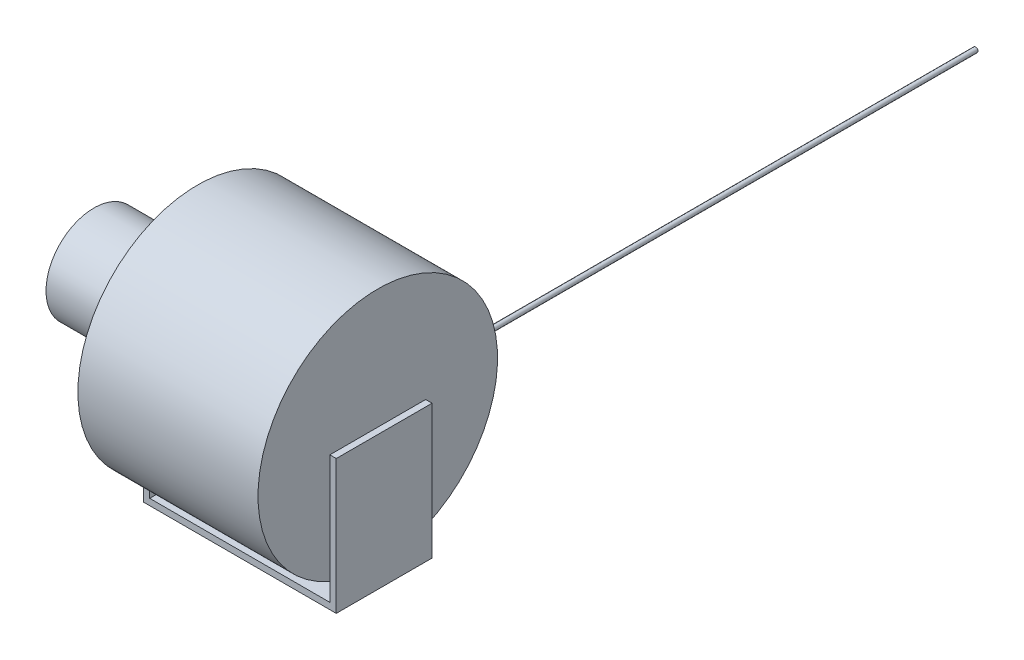
ISO-10303-21;
HEADER;
FILE_DESCRIPTION(('STEP AP214'),'2;1');
FILE_NAME('part.step','',(''),(''),'','','');
FILE_SCHEMA(('AUTOMOTIVE_DESIGN { 1 0 10303 214 1 1 1 1 }'));
ENDSEC;
DATA;
#1=APPLICATION_CONTEXT('core data for automotive mechanical design processes');
#2=APPLICATION_PROTOCOL_DEFINITION('international standard','automotive_design',2000,#1);
#3=PRODUCT_CONTEXT('',#1,'mechanical');
#4=PRODUCT('Part','Part','',(#3));
#5=PRODUCT_RELATED_PRODUCT_CATEGORY('part','',(#4));
#6=PRODUCT_DEFINITION_FORMATION('','',#4);
#7=PRODUCT_DEFINITION_CONTEXT('part definition',#1,'design');
#8=PRODUCT_DEFINITION('design','',#6,#7);
#9=PRODUCT_DEFINITION_SHAPE('','',#8);
#10=(LENGTH_UNIT() NAMED_UNIT(*) SI_UNIT(.MILLI.,.METRE.));
#11=(NAMED_UNIT(*) PLANE_ANGLE_UNIT() SI_UNIT($,.RADIAN.));
#12=(NAMED_UNIT(*) SI_UNIT($,.STERADIAN.) SOLID_ANGLE_UNIT());
#13=UNCERTAINTY_MEASURE_WITH_UNIT(LENGTH_MEASURE(1.E-05),#10,'distance_accuracy_value','');
#14=(GEOMETRIC_REPRESENTATION_CONTEXT(3) GLOBAL_UNCERTAINTY_ASSIGNED_CONTEXT((#13)) GLOBAL_UNIT_ASSIGNED_CONTEXT((#10,
#11,#12)) REPRESENTATION_CONTEXT('',''));
#15=CARTESIAN_POINT('',(0.,0.,0.));
#16=DIRECTION('',(0.,0.,1.));
#17=DIRECTION('',(1.,0.,0.));
#18=AXIS2_PLACEMENT_3D('',#15,#16,#17);
#19=CARTESIAN_POINT('',(282.,0.,0.));
#20=DIRECTION('',(-1.,0.,0.));
#21=DIRECTION('',(0.,0.,1.));
#22=AXIS2_PLACEMENT_3D('',#19,#20,#21);
#23=CYLINDRICAL_SURFACE('',#22,187.5);
#24=CARTESIAN_POINT('',(0.,0.,0.));
#25=DIRECTION('',(1.,0.,0.));
#26=DIRECTION('',(0.,0.,-1.));
#27=AXIS2_PLACEMENT_3D('',#24,#25,#26);
#28=CIRCLE('',#27,187.5);
#29=CARTESIAN_POINT('',(0.,-171.846588560844,75.));
#30=VERTEX_POINT('',#29);
#31=CARTESIAN_POINT('',(0.,-171.846588560844,-75.));
#32=VERTEX_POINT('',#31);
#33=EDGE_CURVE('E147',#30,#32,#28,.T.);
#34=ORIENTED_EDGE('',*,*,#33,.T.);
#35=EDGE_CURVE('E236',#32,#30,#28,.T.);
#36=ORIENTED_EDGE('',*,*,#35,.T.);
#37=EDGE_LOOP('',(#34,#36));
#38=FACE_BOUND('',#37,.T.);
#39=CARTESIAN_POINT('',(282.,0.,0.));
#40=DIRECTION('',(1.,0.,0.));
#41=DIRECTION('',(0.,0.,-1.));
#42=AXIS2_PLACEMENT_3D('',#39,#40,#41);
#43=CIRCLE('',#42,187.5);
#44=CARTESIAN_POINT('',(282.,-171.846588560844,75.));
#45=VERTEX_POINT('',#44);
#46=CARTESIAN_POINT('',(282.,-171.846588560844,-75.));
#47=VERTEX_POINT('',#46);
#48=EDGE_CURVE('E152',#45,#47,#43,.T.);
#49=ORIENTED_EDGE('',*,*,#48,.F.);
#50=EDGE_CURVE('E154',#47,#45,#43,.T.);
#51=ORIENTED_EDGE('',*,*,#50,.F.);
#52=EDGE_LOOP('',(#49,#51));
#53=FACE_BOUND('',#52,.T.);
#54=DIRECTION('',(-1.,0.,0.));
#55=VECTOR('',#54,1.);
#56=CARTESIAN_POINT('',(282.,-187.5,0.));
#57=LINE('',#56,#55);
#58=CARTESIAN_POINT('',(54.5,-187.5,0.));
#59=VERTEX_POINT('',#58);
#60=CARTESIAN_POINT('',(46.9,-187.5,0.));
#61=VERTEX_POINT('',#60);
#62=EDGE_CURVE('E11',#59,#61,#57,.T.);
#63=ORIENTED_EDGE('',*,*,#62,.F.);
#64=CARTESIAN_POINT('',(54.5,-187.5,0.));
#65=CARTESIAN_POINT('',(54.4999824772776,-187.500000118427,-0.633424812998008));
#66=CARTESIAN_POINT('',(54.499999371954,-187.496790188283,-1.26684962907386));
#67=CARTESIAN_POINT('',(54.4999762268592,-187.483951127179,-2.53362961792363));
#68=CARTESIAN_POINT('',(54.4999361874997,-187.474322042639,-3.16698479116805));
#69=CARTESIAN_POINT('',(54.4996733734448,-187.44864214647,-4.43373383816915));
#70=CARTESIAN_POINT('',(54.4994505500365,-187.432589623542,-5.06712767722962));
#71=CARTESIAN_POINT('',(54.4985722962712,-187.394064401529,-6.33372458783351));
#72=CARTESIAN_POINT('',(54.4979168626739,-187.371591654358,-6.96692765791254));
#73=CARTESIAN_POINT('',(54.4958313656798,-187.320207365941,-8.23359033330879));
#74=CARTESIAN_POINT('',(54.4944006689058,-187.291290571403,-8.86704972461049));
#75=CARTESIAN_POINT('',(54.490319941091,-187.227031872245,-10.1336385259812));
#76=CARTESIAN_POINT('',(54.4876699108114,-187.191689971636,-10.7667679362559));
#77=CARTESIAN_POINT('',(54.4806021822254,-187.114582757247,-12.0326661754178));
#78=CARTESIAN_POINT('',(54.4761843726716,-187.072817039316,-12.6654349791018));
#79=CARTESIAN_POINT('',(54.4649211462919,-186.982869690701,-13.9304899895));
#80=CARTESIAN_POINT('',(54.458075751287,-186.934688117692,-14.562776200501));
#81=CARTESIAN_POINT('',(54.4411722576911,-186.831910366129,-15.8268578519086));
#82=CARTESIAN_POINT('',(54.4311137941678,-186.777313459383,-16.4586532283927));
#83=CARTESIAN_POINT('',(54.4068553454479,-186.661720468519,-17.7215740820794));
#84=CARTESIAN_POINT('',(54.3926554045928,-186.600724452918,-18.3526995663816));
#85=CARTESIAN_POINT('',(54.3590090515758,-186.47235320213,-19.6141113214793));
#86=CARTESIAN_POINT('',(54.3395630795642,-186.404978502432,-20.2443976582242));
#87=CARTESIAN_POINT('',(54.2940895327265,-186.263869446385,-21.5040127127352));
#88=CARTESIAN_POINT('',(54.2680620855783,-186.190135213427,-22.1333414488402));
#89=CARTESIAN_POINT('',(54.2077749739849,-186.036323744766,-23.3909734988482));
#90=CARTESIAN_POINT('',(54.1735135616537,-185.956245164724,-24.0192765664756));
#91=CARTESIAN_POINT('',(54.0946623520816,-185.789809595233,-25.2744428144783));
#92=CARTESIAN_POINT('',(54.0500720329202,-185.703452288671,-25.9013059204751));
#93=CARTESIAN_POINT('',(53.9478339692521,-185.524593796126,-27.1527966565233));
#94=CARTESIAN_POINT('',(53.8901928952217,-185.432095765788,-27.7774252635706));
#95=CARTESIAN_POINT('',(53.7909727615141,-185.288839581068,-28.7122855507101));
#96=CARTESIAN_POINT('',(53.7557748734541,-185.240338328345,-29.0235442889877));
#97=CARTESIAN_POINT('',(53.6804439330576,-185.141863222087,-29.6452274269418));
#98=CARTESIAN_POINT('',(53.6403110295331,-185.091889412991,-29.9556518514883));
#99=CARTESIAN_POINT('',(53.5631002833752,-185.000911234695,-30.511885359387));
#100=CARTESIAN_POINT('',(53.5270849174587,-184.960170153332,-30.7578848088501));
#101=CARTESIAN_POINT('',(53.4508707364032,-184.877813697329,-31.2490962600433));
#102=CARTESIAN_POINT('',(53.4106718527476,-184.83619830838,-31.4943082488087));
#103=CARTESIAN_POINT('',(53.3254139105878,-184.752130163623,-31.9837781847893));
#104=CARTESIAN_POINT('',(53.2803542682803,-184.709677307733,-32.2280360137461));
#105=CARTESIAN_POINT('',(53.18450421325,-184.624000377655,-32.7152817902282));
#106=CARTESIAN_POINT('',(53.1337141349475,-184.580776348596,-32.9582698109927));
#107=CARTESIAN_POINT('',(53.0193583261608,-184.488931853758,-33.4687668034435));
#108=CARTESIAN_POINT('',(52.9550050541532,-184.440233146771,-33.7360869241306));
#109=CARTESIAN_POINT('',(52.8155853593365,-184.342215939266,-34.2676280204516));
#110=CARTESIAN_POINT('',(52.7405276229526,-184.292897970572,-34.5318513227575));
#111=CARTESIAN_POINT('',(52.5993137317499,-184.207993296485,-34.9814482347508));
#112=CARTESIAN_POINT('',(52.5366692917565,-184.172478738763,-35.1679337032965));
#113=CARTESIAN_POINT('',(52.4016840695511,-184.101448430046,-35.5378975094847));
#114=CARTESIAN_POINT('',(52.3293237698678,-184.065932824378,-35.7213689374464));
#115=CARTESIAN_POINT('',(52.2101653011699,-184.012691302288,-35.9942815203409));
#116=CARTESIAN_POINT('',(52.1681926454504,-183.994767201167,-36.0857890354467));
#117=CARTESIAN_POINT('',(52.0801305898268,-183.959166183015,-36.2668398533515));
#118=CARTESIAN_POINT('',(52.034042304129,-183.941489200572,-36.3563836796436));
#119=CARTESIAN_POINT('',(51.9369661827703,-183.906593896845,-36.5324890077474));
#120=CARTESIAN_POINT('',(51.8859951893201,-183.889374243213,-36.6190594549238));
#121=CARTESIAN_POINT('',(51.7777567077863,-183.855598029671,-36.7882655751769));
#122=CARTESIAN_POINT('',(51.7204959220667,-183.839040789086,-36.8709053047435));
#123=CARTESIAN_POINT('',(51.6174672229909,-183.812168740642,-37.0045899453224));
#124=CARTESIAN_POINT('',(51.5739067797045,-183.801555574332,-37.0572645070326));
#125=CARTESIAN_POINT('',(51.4821289352379,-183.781063099837,-37.1587610442582));
#126=CARTESIAN_POINT('',(51.4339047557892,-183.771184897863,-37.207577219045));
#127=CARTESIAN_POINT('',(51.3314331691679,-183.752462196119,-37.2999313078725));
#128=CARTESIAN_POINT('',(51.2771286177606,-183.743629445885,-37.3434094004922));
#129=CARTESIAN_POINT('',(51.1621449273767,-183.727764398755,-37.4213864989825));
#130=CARTESIAN_POINT('',(51.1014855492358,-183.72072674132,-37.4559122437561));
#131=CARTESIAN_POINT('',(50.9958759603508,-183.711303231501,-37.5020989119035));
#132=CARTESIAN_POINT('',(50.9526663760947,-183.708149731974,-37.5175407887694));
#133=CARTESIAN_POINT('',(50.8642561725495,-183.70329469982,-37.5413061287013));
#134=CARTESIAN_POINT('',(50.8190583459455,-183.701591194956,-37.549639260884));
#135=CARTESIAN_POINT('',(50.7276105540435,-183.699824183431,-37.5582829443737));
#136=CARTESIAN_POINT('',(50.6813563752987,-183.699769150131,-37.5585520454962));
#137=CARTESIAN_POINT('',(50.5895478101722,-183.701327357977,-37.5509299446127));
#138=CARTESIAN_POINT('',(50.543993956462,-183.702941810847,-37.5430328155026));
#139=CARTESIAN_POINT('',(50.4470436368005,-183.708065366303,-37.5179544398582));
#140=CARTESIAN_POINT('',(50.39602772779,-183.71185762876,-37.4993852282628));
#141=CARTESIAN_POINT('',(50.2977368563396,-183.721027228395,-37.4544347247464));
#142=CARTESIAN_POINT('',(50.2504694022356,-183.726407649821,-37.4280382315708));
#143=CARTESIAN_POINT('',(50.1310661576699,-183.742086032769,-37.3510128401818));
#144=CARTESIAN_POINT('',(50.062165780194,-183.753338886146,-37.2956314850647));
#145=CARTESIAN_POINT('',(49.9331293308463,-183.777604667337,-37.1758766975203));
#146=CARTESIAN_POINT('',(49.8730197904459,-183.790622703691,-37.1114771475185));
#147=CARTESIAN_POINT('',(49.7368030710812,-183.82318515852,-36.9499096360354));
#148=CARTESIAN_POINT('',(49.6640747076052,-183.843237676008,-36.8500326500039));
#149=CARTESIAN_POINT('',(49.5284143331994,-183.884424651443,-36.6439559446608));
#150=CARTESIAN_POINT('',(49.4655040788345,-183.905561378119,-36.5377428845023));
#151=CARTESIAN_POINT('',(49.3468291939905,-183.94853203589,-36.3207909940611));
#152=CARTESIAN_POINT('',(49.2911058906739,-183.970369169522,-36.210030432247));
#153=CARTESIAN_POINT('',(49.1856115830874,-184.014331885213,-35.9859513786788));
#154=CARTESIAN_POINT('',(49.1358343026063,-184.036457135294,-35.8726357368507));
#155=CARTESIAN_POINT('',(49.0429865246332,-184.079938451614,-35.6488248413599));
#156=CARTESIAN_POINT('',(48.9997234370165,-184.101288338926,-35.5384076676294));
#157=CARTESIAN_POINT('',(48.9168296249667,-184.144039394181,-35.3162224050752));
#158=CARTESIAN_POINT('',(48.877199326799,-184.165440567838,-35.2044541594562));
#159=CARTESIAN_POINT('',(48.7628759274541,-184.229643176146,-34.8674754154418));
#160=CARTESIAN_POINT('',(48.6927925294379,-184.272423257558,-34.6406960595539));
#161=CARTESIAN_POINT('',(48.5617570681187,-184.357706977806,-34.1839149689852));
#162=CARTESIAN_POINT('',(48.5008272017644,-184.400209712965,-33.9539068343664));
#163=CARTESIAN_POINT('',(48.3863954624299,-184.484658177138,-33.4920288601258));
#164=CARTESIAN_POINT('',(48.3328915960148,-184.52660405289,-33.2601595378694));
#165=CARTESIAN_POINT('',(48.2318777826651,-184.609903401265,-32.7946575816895));
#166=CARTESIAN_POINT('',(48.1843767555343,-184.651255913215,-32.5610228579534));
#167=CARTESIAN_POINT('',(48.0944818363027,-184.733237815124,-32.092637464258));
#168=CARTESIAN_POINT('',(48.0520882570724,-184.773867160655,-31.8578867268489));
#169=CARTESIAN_POINT('',(47.9717301629574,-184.854292221063,-31.3878545701229));
#170=CARTESIAN_POINT('',(47.9337592426981,-184.8940890713,-31.1525744342863));
#171=CARTESIAN_POINT('',(47.8616053073443,-184.97287464545,-30.6813090839925));
#172=CARTESIAN_POINT('',(47.8274221995927,-185.011863389112,-30.4453238869275));
#173=CARTESIAN_POINT('',(47.7304027273396,-185.126913920587,-29.7405618069634));
#174=CARTESIAN_POINT('',(47.6724199696108,-185.201755412642,-29.2709146249951));
#175=CARTESIAN_POINT('',(47.5667687029756,-185.348030681155,-28.3299189267176));
#176=CARTESIAN_POINT('',(47.5191010493001,-185.419464174673,-27.8585702726298));
#177=CARTESIAN_POINT('',(47.4321700809588,-185.558857573187,-26.9144595245098));
#178=CARTESIAN_POINT('',(47.3929090812939,-185.62681651746,-26.4416970773997));
#179=CARTESIAN_POINT('',(47.3213572502173,-185.759187727528,-25.495147753056));
#180=CARTESIAN_POINT('',(47.289066544063,-185.823599929572,-25.0213608575675));
#181=CARTESIAN_POINT('',(47.2302728268303,-185.948938324967,-24.0722212110144));
#182=CARTESIAN_POINT('',(47.2037788623914,-186.009858961423,-23.5968671711777));
#183=CARTESIAN_POINT('',(47.1557227661704,-186.128081870445,-22.6454618512427));
#184=CARTESIAN_POINT('',(47.134160665906,-186.185384119885,-22.1694105667081));
#185=CARTESIAN_POINT('',(47.0756966558206,-186.351818500852,-20.740523254281));
#186=CARTESIAN_POINT('',(47.0450075935464,-186.455499599418,-19.7867922323171));
#187=CARTESIAN_POINT('',(46.9953852386686,-186.6481400874,-17.8784975334934));
#188=CARTESIAN_POINT('',(46.97644065093,-186.737113561134,-16.9239355435773));
#189=CARTESIAN_POINT('',(46.9466826444016,-186.900420018997,-15.0134015426085));
#190=CARTESIAN_POINT('',(46.9358695385819,-186.97475243953,-14.0574294787025));
#191=CARTESIAN_POINT('',(46.9196001726134,-187.108698188631,-12.1450888460019));
#192=CARTESIAN_POINT('',(46.9141401633136,-187.168321796885,-11.1887210247004));
#193=CARTESIAN_POINT('',(46.9064293661195,-187.272899408107,-9.27519508428305));
#194=CARTESIAN_POINT('',(46.9041784921513,-187.317853804502,-8.31803698705272));
#195=CARTESIAN_POINT('',(46.9018342392711,-187.379564543236,-6.74726307524546));
#196=CARTESIAN_POINT('',(46.9012561958344,-187.400648561472,-6.1338143024358));
#197=CARTESIAN_POINT('',(46.9004825126984,-187.436792687159,-4.90668560385456));
#198=CARTESIAN_POINT('',(46.9002869055043,-187.451852282478,-4.29300566286826));
#199=CARTESIAN_POINT('',(46.9000562022643,-187.475932022047,-3.0661081994499));
#200=CARTESIAN_POINT('',(46.9000209546014,-187.484957864212,-2.45289078853788));
#201=CARTESIAN_POINT('',(46.9000004805331,-187.49699164661,-1.22644897079607));
#202=CARTESIAN_POINT('',(46.9000152498826,-187.500000097534,-0.613224568977308));
#203=CARTESIAN_POINT('',(46.9,-187.5,0.));
#204=B_SPLINE_CURVE_WITH_KNOTS('',3,(#64,#65,#66,#67,#68,#69,#70,#71,#72,#73,#74,#75,#76,#77,
#78,#79,#80,#81,#82,#83,#84,#85,#86,#87,#88,#89,#90,#91,#92,#93,#94,#95,#96,#97,#98,#99,#100,
#101,#102,#103,#104,#105,#106,#107,#108,#109,#110,#111,#112,#113,#114,#115,#116,#117,#118,#119,
#120,#121,#122,#123,#124,#125,#126,#127,#128,#129,#130,#131,#132,#133,#134,#135,#136,#137,#138,
#139,#140,#141,#142,#143,#144,#145,#146,#147,#148,#149,#150,#151,#152,#153,#154,#155,#156,#157,
#158,#159,#160,#161,#162,#163,#164,#165,#166,#167,#168,#169,#170,#171,#172,#173,#174,#175,#176,
#177,#178,#179,#180,#181,#182,#183,#184,#185,#186,#187,#188,#189,#190,#191,#192,#193,#194,#195,
#196,#197,#198,#199,#200,#201,#202,#203),.UNSPECIFIED.,.F.,.F.,(4,2,2,2,2,2,2,2,2,2,2,2,2,2,2,2,
2,2,2,2,2,2,2,2,2,2,2,2,2,2,2,2,2,2,2,2,2,2,2,2,2,2,2,2,2,2,2,2,2,2,2,2,2,2,2,2,2,2,2,2,2,2,2,2,
2,2,2,2,2,4),(0.,1.90026631167775,3.80051888167974,5.70127804428522,7.6020514436584,
9.50438009014794,11.4067075491884,13.3091547415195,15.2115848335866,17.1142310758594,
19.0168569478548,20.9193232361977,22.8217526203241,24.7245862047824,26.6275159605884,
28.5294752815761,29.4803675650246,30.431231182003,31.1870132094229,31.942807616798,
32.698692900413,33.4545340944127,34.292084488333,35.128959056313,35.7285112162419,
36.3292863123431,36.6359832360507,36.9425973793391,37.2481895764441,37.5534592387219,
37.7607799568524,37.9684066573955,38.178181043328,38.3873214630075,38.5247884808012,
38.6620682202893,38.8000534753893,38.938138951445,39.1004973725738,39.2631731962287,
39.5289970952829,39.7956074113719,40.1701817882362,40.5455747698388,40.9230383127107,
41.3000998429597,41.6615151421158,42.0229727950011,42.7462329904829,43.4712196946801,
44.1960114055233,44.9218677501938,45.6477685365653,46.3726045661,47.0974228608681,
48.5345306150536,49.9717574750096,51.4093796069253,52.8470275710283,54.2869034338077,
55.7267884980912,58.6060691196385,61.4825763074448,64.359194202615,67.2337959571283,
70.1083206088461,71.9497277784282,73.7912914513154,75.6311135955478,77.470779588625),.UNSPECIFIED.);
#205=EDGE_CURVE('E48',#59,#61,#204,.T.);
#206=ORIENTED_EDGE('',*,*,#205,.T.);
#207=EDGE_LOOP('',(#63,#206));
#208=FACE_BOUND('',#207,.T.);
#209=ADVANCED_FACE('F39',(#38,#53,#208),#23,.T.);
#210=CARTESIAN_POINT('',(0.,0.,0.));
#211=DIRECTION('',(-1.,0.,0.));
#212=DIRECTION('',(0.,0.,1.));
#213=AXIS2_PLACEMENT_3D('',#210,#211,#212);
#214=PLANE('',#213);
#215=DIRECTION('',(0.,0.,1.));
#216=VECTOR('',#215,1.);
#217=CARTESIAN_POINT('',(0.,-200.,-75.));
#218=LINE('',#217,#216);
#219=CARTESIAN_POINT('',(0.,-200.,-75.));
#220=VERTEX_POINT('',#219);
#221=CARTESIAN_POINT('',(0.,-200.,75.));
#222=VERTEX_POINT('',#221);
#223=EDGE_CURVE('E61',#220,#222,#218,.T.);
#224=ORIENTED_EDGE('',*,*,#223,.F.);
#225=DIRECTION('',(0.,-1.,0.));
#226=VECTOR('',#225,1.);
#227=CARTESIAN_POINT('',(0.,0.,-75.));
#228=LINE('',#227,#226);
#229=EDGE_CURVE('E196',#32,#220,#228,.T.);
#230=ORIENTED_EDGE('',*,*,#229,.F.);
#231=ORIENTED_EDGE('',*,*,#33,.F.);
#232=DIRECTION('',(0.,1.,0.));
#233=VECTOR('',#232,1.);
#234=CARTESIAN_POINT('',(0.,0.,75.));
#235=LINE('',#234,#233);
#236=EDGE_CURVE('E218',#222,#30,#235,.T.);
#237=ORIENTED_EDGE('',*,*,#236,.F.);
#238=EDGE_LOOP('',(#224,#230,#231,#237));
#239=FACE_BOUND('',#238,.T.);
#240=ADVANCED_FACE('F133',(#239),#214,.F.);
#241=CARTESIAN_POINT('',(282.,0.,0.));
#242=DIRECTION('',(1.,0.,0.));
#243=DIRECTION('',(0.,0.,-1.));
#244=AXIS2_PLACEMENT_3D('',#241,#242,#243);
#245=PLANE('',#244);
#246=DIRECTION('',(0.,0.,1.));
#247=VECTOR('',#246,1.);
#248=CARTESIAN_POINT('',(282.,-200.,-75.));
#249=LINE('',#248,#247);
#250=CARTESIAN_POINT('',(282.,-200.,-75.));
#251=VERTEX_POINT('',#250);
#252=CARTESIAN_POINT('',(282.,-200.,75.));
#253=VERTEX_POINT('',#252);
#254=EDGE_CURVE('E165',#251,#253,#249,.T.);
#255=ORIENTED_EDGE('',*,*,#254,.T.);
#256=DIRECTION('',(0.,-1.,0.));
#257=VECTOR('',#256,1.);
#258=CARTESIAN_POINT('',(282.,0.,75.));
#259=LINE('',#258,#257);
#260=EDGE_CURVE('E162',#45,#253,#259,.T.);
#261=ORIENTED_EDGE('',*,*,#260,.F.);
#262=ORIENTED_EDGE('',*,*,#48,.T.);
#263=DIRECTION('',(0.,1.,0.));
#264=VECTOR('',#263,1.);
#265=CARTESIAN_POINT('',(282.,0.,-75.));
#266=LINE('',#265,#264);
#267=EDGE_CURVE('E178',#251,#47,#266,.T.);
#268=ORIENTED_EDGE('',*,*,#267,.F.);
#269=EDGE_LOOP('',(#255,#261,#262,#268));
#270=FACE_BOUND('',#269,.T.);
#271=ADVANCED_FACE('F140',(#270),#245,.F.);
#272=CARTESIAN_POINT('',(0.,0.,0.));
#273=DIRECTION('',(1.,0.,0.));
#274=DIRECTION('',(0.,0.,-1.));
#275=AXIS2_PLACEMENT_3D('',#272,#273,#274);
#276=PLANE('',#275);
#277=CARTESIAN_POINT('',(0.,0.,-75.));
#278=VERTEX_POINT('',#277);
#279=EDGE_CURVE('E214',#278,#32,#228,.T.);
#280=ORIENTED_EDGE('',*,*,#279,.F.);
#281=DIRECTION('',(0.,0.,-1.));
#282=VECTOR('',#281,1.);
#283=CARTESIAN_POINT('',(0.,0.,-75.));
#284=LINE('',#283,#282);
#285=CARTESIAN_POINT('',(0.,0.,75.));
#286=VERTEX_POINT('',#285);
#287=EDGE_CURVE('E202',#286,#278,#284,.T.);
#288=ORIENTED_EDGE('',*,*,#287,.F.);
#289=EDGE_CURVE('E158',#30,#286,#235,.T.);
#290=ORIENTED_EDGE('',*,*,#289,.F.);
#291=ORIENTED_EDGE('',*,*,#35,.F.);
#292=EDGE_LOOP('',(#280,#288,#290,#291));
#293=FACE_BOUND('',#292,.T.);
#294=ADVANCED_FACE('F273',(#293),#276,.F.);
#295=CARTESIAN_POINT('',(282.,0.,0.));
#296=DIRECTION('',(1.,0.,0.));
#297=DIRECTION('',(0.,0.,-1.));
#298=AXIS2_PLACEMENT_3D('',#295,#296,#297);
#299=PLANE('',#298);
#300=CARTESIAN_POINT('',(282.,0.,75.));
#301=VERTEX_POINT('',#300);
#302=EDGE_CURVE('E168',#301,#45,#259,.T.);
#303=ORIENTED_EDGE('',*,*,#302,.F.);
#304=DIRECTION('',(0.,0.,1.));
#305=VECTOR('',#304,1.);
#306=CARTESIAN_POINT('',(282.,0.,75.));
#307=LINE('',#306,#305);
#308=CARTESIAN_POINT('',(282.,0.,-75.));
#309=VERTEX_POINT('',#308);
#310=EDGE_CURVE('E180',#309,#301,#307,.T.);
#311=ORIENTED_EDGE('',*,*,#310,.F.);
#312=EDGE_CURVE('E182',#47,#309,#266,.T.);
#313=ORIENTED_EDGE('',*,*,#312,.F.);
#314=ORIENTED_EDGE('',*,*,#50,.T.);
#315=EDGE_LOOP('',(#303,#311,#313,#314));
#316=FACE_BOUND('',#315,.T.);
#317=ADVANCED_FACE('F294',(#316),#299,.T.);
#318=CARTESIAN_POINT('',(-10.,0.,-75.));
#319=DIRECTION('',(0.,0.,1.));
#320=DIRECTION('',(0.,-1.,0.));
#321=AXIS2_PLACEMENT_3D('',#318,#319,#320);
#322=PLANE('',#321);
#323=ORIENTED_EDGE('',*,*,#279,.T.);
#324=ORIENTED_EDGE('',*,*,#229,.T.);
#325=DIRECTION('',(-1.,0.,0.));
#326=VECTOR('',#325,1.);
#327=CARTESIAN_POINT('',(292.002,-200.,-75.));
#328=LINE('',#327,#326);
#329=EDGE_CURVE('E343',#251,#220,#328,.T.);
#330=ORIENTED_EDGE('',*,*,#329,.F.);
#331=ORIENTED_EDGE('',*,*,#267,.T.);
#332=ORIENTED_EDGE('',*,*,#312,.T.);
#333=DIRECTION('',(-1.,0.,0.));
#334=VECTOR('',#333,1.);
#335=CARTESIAN_POINT('',(292.,0.,-75.));
#336=LINE('',#335,#334);
#337=CARTESIAN_POINT('',(292.,0.,-75.));
#338=VERTEX_POINT('',#337);
#339=EDGE_CURVE('E192',#338,#309,#336,.T.);
#340=ORIENTED_EDGE('',*,*,#339,.F.);
#341=DIRECTION('',(0.,1.,0.));
#342=VECTOR('',#341,1.);
#343=CARTESIAN_POINT('',(292.,0.,-75.));
#344=LINE('',#343,#342);
#345=CARTESIAN_POINT('',(292.,-210.,-75.));
#346=VERTEX_POINT('',#345);
#347=EDGE_CURVE('E332',#346,#338,#344,.T.);
#348=ORIENTED_EDGE('',*,*,#347,.F.);
#349=DIRECTION('',(1.,0.,0.));
#350=VECTOR('',#349,1.);
#351=CARTESIAN_POINT('',(-10.,-210.,-75.));
#352=LINE('',#351,#350);
#353=CARTESIAN_POINT('',(-10.,-210.,-75.));
#354=VERTEX_POINT('',#353);
#355=EDGE_CURVE('E234',#354,#346,#352,.T.);
#356=ORIENTED_EDGE('',*,*,#355,.F.);
#357=DIRECTION('',(0.,-1.,0.));
#358=VECTOR('',#357,1.);
#359=CARTESIAN_POINT('',(-10.,0.,-75.));
#360=LINE('',#359,#358);
#361=CARTESIAN_POINT('',(-10.,0.,-75.));
#362=VERTEX_POINT('',#361);
#363=EDGE_CURVE('E197',#362,#354,#360,.T.);
#364=ORIENTED_EDGE('',*,*,#363,.F.);
#365=DIRECTION('',(1.,0.,0.));
#366=VECTOR('',#365,1.);
#367=CARTESIAN_POINT('',(-10.,0.,-75.));
#368=LINE('',#367,#366);
#369=EDGE_CURVE('E213',#362,#278,#368,.T.);
#370=ORIENTED_EDGE('',*,*,#369,.T.);
#371=EDGE_LOOP('',(#323,#324,#330,#331,#332,#340,#348,#356,#364,#370));
#372=FACE_BOUND('',#371,.T.);
#373=ADVANCED_FACE('F290',(#372),#322,.F.);
#374=CARTESIAN_POINT('',(-10.,-210.,-75.));
#375=DIRECTION('',(0.,1.,0.));
#376=DIRECTION('',(0.,0.,1.));
#377=AXIS2_PLACEMENT_3D('',#374,#375,#376);
#378=PLANE('',#377);
#379=ORIENTED_EDGE('',*,*,#355,.T.);
#380=DIRECTION('',(0.,0.,-1.));
#381=VECTOR('',#380,1.);
#382=CARTESIAN_POINT('',(292.,-210.,75.));
#383=LINE('',#382,#381);
#384=CARTESIAN_POINT('',(292.,-210.,75.));
#385=VERTEX_POINT('',#384);
#386=EDGE_CURVE('E334',#385,#346,#383,.T.);
#387=ORIENTED_EDGE('',*,*,#386,.F.);
#388=DIRECTION('',(1.,0.,0.));
#389=VECTOR('',#388,1.);
#390=CARTESIAN_POINT('',(-10.,-210.,75.));
#391=LINE('',#390,#389);
#392=CARTESIAN_POINT('',(-10.,-210.,75.));
#393=VERTEX_POINT('',#392);
#394=EDGE_CURVE('E231',#393,#385,#391,.T.);
#395=ORIENTED_EDGE('',*,*,#394,.F.);
#396=DIRECTION('',(0.,0.,1.));
#397=VECTOR('',#396,1.);
#398=CARTESIAN_POINT('',(-10.,-210.,-75.));
#399=LINE('',#398,#397);
#400=EDGE_CURVE('E201',#354,#393,#399,.T.);
#401=ORIENTED_EDGE('',*,*,#400,.F.);
#402=EDGE_LOOP('',(#379,#387,#395,#401));
#403=FACE_BOUND('',#402,.T.);
#404=ADVANCED_FACE('F287',(#403),#378,.F.);
#405=CARTESIAN_POINT('',(-10.,0.,75.));
#406=DIRECTION('',(0.,0.,-1.));
#407=DIRECTION('',(-1.,0.,0.));
#408=AXIS2_PLACEMENT_3D('',#405,#406,#407);
#409=PLANE('',#408);
#410=ORIENTED_EDGE('',*,*,#394,.T.);
#411=DIRECTION('',(0.,-1.,0.));
#412=VECTOR('',#411,1.);
#413=CARTESIAN_POINT('',(292.,0.,75.));
#414=LINE('',#413,#412);
#415=CARTESIAN_POINT('',(292.,0.,75.));
#416=VERTEX_POINT('',#415);
#417=EDGE_CURVE('E189',#416,#385,#414,.T.);
#418=ORIENTED_EDGE('',*,*,#417,.F.);
#419=DIRECTION('',(-1.,0.,0.));
#420=VECTOR('',#419,1.);
#421=CARTESIAN_POINT('',(292.,0.,75.));
#422=LINE('',#421,#420);
#423=EDGE_CURVE('E174',#416,#301,#422,.T.);
#424=ORIENTED_EDGE('',*,*,#423,.T.);
#425=ORIENTED_EDGE('',*,*,#302,.T.);
#426=ORIENTED_EDGE('',*,*,#260,.T.);
#427=DIRECTION('',(-1.,0.,0.));
#428=VECTOR('',#427,1.);
#429=CARTESIAN_POINT('',(292.002,-200.,75.));
#430=LINE('',#429,#428);
#431=EDGE_CURVE('E344',#253,#222,#430,.T.);
#432=ORIENTED_EDGE('',*,*,#431,.T.);
#433=ORIENTED_EDGE('',*,*,#236,.T.);
#434=ORIENTED_EDGE('',*,*,#289,.T.);
#435=DIRECTION('',(1.,0.,0.));
#436=VECTOR('',#435,1.);
#437=CARTESIAN_POINT('',(-10.,0.,75.));
#438=LINE('',#437,#436);
#439=CARTESIAN_POINT('',(-10.,0.,75.));
#440=VERTEX_POINT('',#439);
#441=EDGE_CURVE('E227',#440,#286,#438,.T.);
#442=ORIENTED_EDGE('',*,*,#441,.F.);
#443=DIRECTION('',(0.,1.,0.));
#444=VECTOR('',#443,1.);
#445=CARTESIAN_POINT('',(-10.,0.,75.));
#446=LINE('',#445,#444);
#447=EDGE_CURVE('E205',#393,#440,#446,.T.);
#448=ORIENTED_EDGE('',*,*,#447,.F.);
#449=EDGE_LOOP('',(#410,#418,#424,#425,#426,#432,#433,#434,#442,#448));
#450=FACE_BOUND('',#449,.T.);
#451=ADVANCED_FACE('F171',(#450),#409,.F.);
#452=CARTESIAN_POINT('',(-10.,0.,-75.));
#453=DIRECTION('',(0.,-1.,0.));
#454=DIRECTION('',(0.,0.,-1.));
#455=AXIS2_PLACEMENT_3D('',#452,#453,#454);
#456=PLANE('',#455);
#457=ORIENTED_EDGE('',*,*,#287,.T.);
#458=ORIENTED_EDGE('',*,*,#369,.F.);
#459=DIRECTION('',(0.,0.,-1.));
#460=VECTOR('',#459,1.);
#461=CARTESIAN_POINT('',(-10.,0.,-75.));
#462=LINE('',#461,#460);
#463=EDGE_CURVE('E209',#440,#362,#462,.T.);
#464=ORIENTED_EDGE('',*,*,#463,.F.);
#465=ORIENTED_EDGE('',*,*,#441,.T.);
#466=EDGE_LOOP('',(#457,#458,#464,#465));
#467=FACE_BOUND('',#466,.T.);
#468=ADVANCED_FACE('F279',(#467),#456,.F.);
#469=CARTESIAN_POINT('',(-10.,0.,0.));
#470=DIRECTION('',(-1.,0.,0.));
#471=DIRECTION('',(0.,0.,1.));
#472=AXIS2_PLACEMENT_3D('',#469,#470,#471);
#473=PLANE('',#472);
#474=CARTESIAN_POINT('',(-10.,0.,0.));
#475=DIRECTION('',(-1.,0.,0.));
#476=DIRECTION('',(0.,0.,1.));
#477=AXIS2_PLACEMENT_3D('',#474,#475,#476);
#478=CIRCLE('',#477,75.);
#479=EDGE_CURVE('E125',#362,#440,#478,.T.);
#480=ORIENTED_EDGE('',*,*,#479,.F.);
#481=ORIENTED_EDGE('',*,*,#363,.T.);
#482=ORIENTED_EDGE('',*,*,#400,.T.);
#483=ORIENTED_EDGE('',*,*,#447,.T.);
#484=EDGE_LOOP('',(#480,#481,#482,#483));
#485=FACE_BOUND('',#484,.T.);
#486=ADVANCED_FACE('F276',(#485),#473,.T.);
#487=CARTESIAN_POINT('',(292.,0.,75.));
#488=DIRECTION('',(0.,-1.,0.));
#489=DIRECTION('',(0.,0.,-1.));
#490=AXIS2_PLACEMENT_3D('',#487,#488,#489);
#491=PLANE('',#490);
#492=ORIENTED_EDGE('',*,*,#310,.T.);
#493=ORIENTED_EDGE('',*,*,#423,.F.);
#494=DIRECTION('',(0.,0.,1.));
#495=VECTOR('',#494,1.);
#496=CARTESIAN_POINT('',(292.,0.,75.));
#497=LINE('',#496,#495);
#498=EDGE_CURVE('E184',#338,#416,#497,.T.);
#499=ORIENTED_EDGE('',*,*,#498,.F.);
#500=ORIENTED_EDGE('',*,*,#339,.T.);
#501=EDGE_LOOP('',(#492,#493,#499,#500));
#502=FACE_BOUND('',#501,.T.);
#503=ADVANCED_FACE('F269',(#502),#491,.F.);
#504=CARTESIAN_POINT('',(292.,0.,0.));
#505=DIRECTION('',(1.,0.,0.));
#506=DIRECTION('',(0.,0.,-1.));
#507=AXIS2_PLACEMENT_3D('',#504,#505,#506);
#508=PLANE('',#507);
#509=ORIENTED_EDGE('',*,*,#417,.T.);
#510=ORIENTED_EDGE('',*,*,#386,.T.);
#511=ORIENTED_EDGE('',*,*,#347,.T.);
#512=ORIENTED_EDGE('',*,*,#498,.T.);
#513=EDGE_LOOP('',(#509,#510,#511,#512));
#514=FACE_BOUND('',#513,.T.);
#515=ADVANCED_FACE('F266',(#514),#508,.T.);
#516=CARTESIAN_POINT('',(292.002,-200.,-75.));
#517=DIRECTION('',(0.,-1.,0.));
#518=DIRECTION('',(0.,0.,-1.));
#519=AXIS2_PLACEMENT_3D('',#516,#517,#518);
#520=PLANE('',#519);
#521=ORIENTED_EDGE('',*,*,#254,.F.);
#522=ORIENTED_EDGE('',*,*,#329,.T.);
#523=ORIENTED_EDGE('',*,*,#223,.T.);
#524=ORIENTED_EDGE('',*,*,#431,.F.);
#525=EDGE_LOOP('',(#521,#522,#523,#524));
#526=FACE_BOUND('',#525,.T.);
#527=ADVANCED_FACE('F259',(#526),#520,.F.);
#528=CARTESIAN_POINT('',(-10.,0.,0.));
#529=DIRECTION('',(-1.,0.,0.));
#530=DIRECTION('',(0.,0.,1.));
#531=AXIS2_PLACEMENT_3D('',#528,#529,#530);
#532=PLANE('',#531);
#533=EDGE_CURVE('E129',#440,#362,#478,.T.);
#534=ORIENTED_EDGE('',*,*,#533,.F.);
#535=ORIENTED_EDGE('',*,*,#463,.T.);
#536=EDGE_LOOP('',(#534,#535));
#537=FACE_BOUND('',#536,.T.);
#538=ADVANCED_FACE('F256',(#537),#532,.F.);
#539=CARTESIAN_POINT('',(-162.4,0.,0.));
#540=DIRECTION('',(1.,0.,0.));
#541=DIRECTION('',(0.,0.,-1.));
#542=AXIS2_PLACEMENT_3D('',#539,#540,#541);
#543=CYLINDRICAL_SURFACE('',#542,75.);
#544=CARTESIAN_POINT('',(-162.4,0.,0.));
#545=DIRECTION('',(-1.,0.,0.));
#546=DIRECTION('',(0.,0.,1.));
#547=AXIS2_PLACEMENT_3D('',#544,#545,#546);
#548=CIRCLE('',#547,75.);
#549=CARTESIAN_POINT('',(-162.4,0.,75.));
#550=VERTEX_POINT('',#549);
#551=EDGE_CURVE('E314',#550,#550,#548,.T.);
#552=ORIENTED_EDGE('',*,*,#551,.F.);
#553=EDGE_LOOP('',(#552));
#554=FACE_BOUND('',#553,.T.);
#555=ORIENTED_EDGE('',*,*,#533,.T.);
#556=ORIENTED_EDGE('',*,*,#479,.T.);
#557=EDGE_LOOP('',(#555,#556));
#558=FACE_BOUND('',#557,.T.);
#559=ADVANCED_FACE('F254',(#554,#558),#543,.T.);
#560=CARTESIAN_POINT('',(-162.4,0.,0.));
#561=DIRECTION('',(-1.,0.,0.));
#562=DIRECTION('',(0.,0.,1.));
#563=AXIS2_PLACEMENT_3D('',#560,#561,#562);
#564=PLANE('',#563);
#565=ORIENTED_EDGE('',*,*,#551,.T.);
#566=EDGE_LOOP('',(#565));
#567=FACE_BOUND('',#566,.T.);
#568=ADVANCED_FACE('F251',(#567),#564,.T.);
#569=CARTESIAN_POINT('',(50.7,-187.5,0.));
#570=DIRECTION('',(0.,0.,-1.));
#571=DIRECTION('',(0.,1.,0.));
#572=AXIS2_PLACEMENT_3D('',#569,#570,#571);
#573=PLANE('',#572);
#574=CARTESIAN_POINT('',(50.7,-187.5,0.));
#575=DIRECTION('',(0.,0.,-1.));
#576=DIRECTION('',(0.,1.,0.));
#577=AXIS2_PLACEMENT_3D('',#574,#575,#576);
#578=CIRCLE('',#577,3.8);
#579=EDGE_CURVE('E54',#59,#61,#578,.T.);
#580=ORIENTED_EDGE('',*,*,#579,.F.);
#581=ORIENTED_EDGE('',*,*,#62,.T.);
#582=EDGE_LOOP('',(#580,#581));
#583=FACE_BOUND('',#582,.T.);
#584=ADVANCED_FACE('F127',(#583),#573,.F.);
#585=CARTESIAN_POINT('',(50.7,-187.5,0.));
#586=DIRECTION('',(0.,0.,-1.));
#587=DIRECTION('',(-1.,0.,0.));
#588=AXIS2_PLACEMENT_3D('',#585,#586,#587);
#589=CYLINDRICAL_SURFACE('',#588,3.8);
#590=ORIENTED_EDGE('',*,*,#205,.F.);
#591=ORIENTED_EDGE('',*,*,#579,.T.);
#592=EDGE_LOOP('',(#590,#591));
#593=FACE_BOUND('',#592,.T.);
#594=CARTESIAN_POINT('',(50.7,-187.5,-1167.2));
#595=DIRECTION('',(0.,0.,-1.));
#596=DIRECTION('',(0.,1.,0.));
#597=AXIS2_PLACEMENT_3D('',#594,#595,#596);
#598=CIRCLE('',#597,3.8);
#599=CARTESIAN_POINT('',(50.7,-183.7,-1167.2));
#600=VERTEX_POINT('',#599);
#601=EDGE_CURVE('E130',#600,#600,#598,.T.);
#602=ORIENTED_EDGE('',*,*,#601,.F.);
#603=EDGE_LOOP('',(#602));
#604=FACE_BOUND('',#603,.T.);
#605=ADVANCED_FACE('F120',(#593,#604),#589,.T.);
#606=CARTESIAN_POINT('',(50.7,-187.5,-1167.2));
#607=DIRECTION('',(0.,0.,-1.));
#608=DIRECTION('',(0.,1.,0.));
#609=AXIS2_PLACEMENT_3D('',#606,#607,#608);
#610=PLANE('',#609);
#611=ORIENTED_EDGE('',*,*,#601,.T.);
#612=EDGE_LOOP('',(#611));
#613=FACE_BOUND('',#612,.T.);
#614=ADVANCED_FACE('F248',(#613),#610,.T.);
#615=CLOSED_SHELL('',(#209,#240,#271,#294,#317,#373,#404,#451,#468,#486,#503,#515,#527,#538,
#559,#568,#584,#605,#614));
#616=MANIFOLD_SOLID_BREP('B2',#615);
#617=ADVANCED_BREP_SHAPE_REPRESENTATION('',(#18,#616),#14);
#618=SHAPE_DEFINITION_REPRESENTATION(#9,#617);
ENDSEC;
END-ISO-10303-21;
